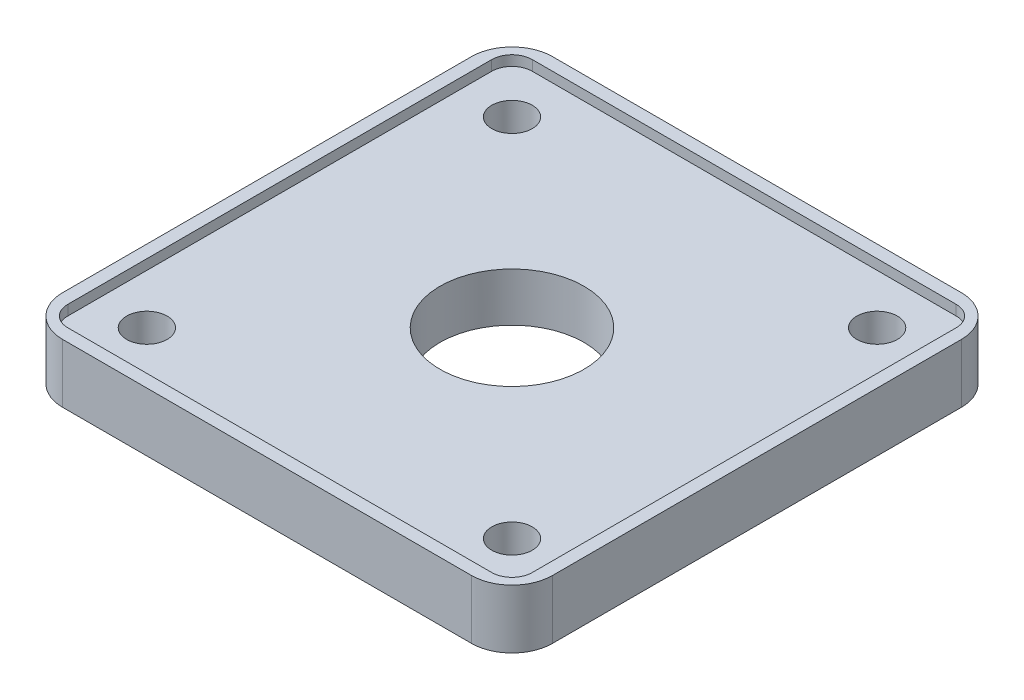
ISO-10303-21;
HEADER;
FILE_DESCRIPTION(('STEP AP214'),'2;1');
FILE_NAME('part.step','',(''),(''),'','','');
FILE_SCHEMA(('AUTOMOTIVE_DESIGN { 1 0 10303 214 1 1 1 1 }'));
ENDSEC;
DATA;
#1=APPLICATION_CONTEXT('core data for automotive mechanical design processes');
#2=APPLICATION_PROTOCOL_DEFINITION('international standard','automotive_design',2000,#1);
#3=PRODUCT_CONTEXT('',#1,'mechanical');
#4=PRODUCT('Part','Part','',(#3));
#5=PRODUCT_RELATED_PRODUCT_CATEGORY('part','',(#4));
#6=PRODUCT_DEFINITION_FORMATION('','',#4);
#7=PRODUCT_DEFINITION_CONTEXT('part definition',#1,'design');
#8=PRODUCT_DEFINITION('design','',#6,#7);
#9=PRODUCT_DEFINITION_SHAPE('','',#8);
#10=(LENGTH_UNIT() NAMED_UNIT(*) SI_UNIT(.MILLI.,.METRE.));
#11=(NAMED_UNIT(*) PLANE_ANGLE_UNIT() SI_UNIT($,.RADIAN.));
#12=(NAMED_UNIT(*) SI_UNIT($,.STERADIAN.) SOLID_ANGLE_UNIT());
#13=UNCERTAINTY_MEASURE_WITH_UNIT(LENGTH_MEASURE(1.E-05),#10,'distance_accuracy_value','');
#14=(GEOMETRIC_REPRESENTATION_CONTEXT(3) GLOBAL_UNCERTAINTY_ASSIGNED_CONTEXT((#13)) GLOBAL_UNIT_ASSIGNED_CONTEXT((#10,
#11,#12)) REPRESENTATION_CONTEXT('',''));
#15=CARTESIAN_POINT('',(0.,0.,0.));
#16=DIRECTION('',(0.,0.,1.));
#17=DIRECTION('',(1.,0.,0.));
#18=AXIS2_PLACEMENT_3D('',#15,#16,#17);
#19=CARTESIAN_POINT('',(20.15,5.8,20.15));
#20=DIRECTION('',(0.,1.,0.));
#21=DIRECTION('',(0.,0.,1.));
#22=AXIS2_PLACEMENT_3D('',#19,#20,#21);
#23=PLANE('',#22);
#24=CARTESIAN_POINT('',(20.9,5.8,-20.9));
#25=DIRECTION('',(0.,1.,0.));
#26=DIRECTION('',(0.,0.,-1.));
#27=AXIS2_PLACEMENT_3D('',#24,#25,#26);
#28=CIRCLE('',#27,2.);
#29=CARTESIAN_POINT('',(22.9,5.8,-20.9));
#30=VERTEX_POINT('',#29);
#31=CARTESIAN_POINT('',(20.9,5.8,-22.9));
#32=VERTEX_POINT('',#31);
#33=EDGE_CURVE('E48',#30,#32,#28,.T.);
#34=ORIENTED_EDGE('',*,*,#33,.F.);
#35=DIRECTION('',(0.,0.,-1.));
#36=VECTOR('',#35,1.);
#37=CARTESIAN_POINT('',(22.9,5.8,20.9));
#38=LINE('',#37,#36);
#39=CARTESIAN_POINT('',(22.9,5.8,20.9));
#40=VERTEX_POINT('',#39);
#41=EDGE_CURVE('E241',#40,#30,#38,.T.);
#42=ORIENTED_EDGE('',*,*,#41,.F.);
#43=CARTESIAN_POINT('',(20.9,5.8,20.9));
#44=DIRECTION('',(0.,1.,0.));
#45=DIRECTION('',(0.,0.,1.));
#46=AXIS2_PLACEMENT_3D('',#43,#44,#45);
#47=CIRCLE('',#46,2.);
#48=CARTESIAN_POINT('',(20.9,5.8,22.9));
#49=VERTEX_POINT('',#48);
#50=EDGE_CURVE('E245',#49,#40,#47,.T.);
#51=ORIENTED_EDGE('',*,*,#50,.F.);
#52=DIRECTION('',(1.,0.,0.));
#53=VECTOR('',#52,1.);
#54=CARTESIAN_POINT('',(-20.9,5.8,22.9));
#55=LINE('',#54,#53);
#56=CARTESIAN_POINT('',(-20.9,5.8,22.9));
#57=VERTEX_POINT('',#56);
#58=EDGE_CURVE('E248',#57,#49,#55,.T.);
#59=ORIENTED_EDGE('',*,*,#58,.F.);
#60=CARTESIAN_POINT('',(-20.9,5.8,20.9));
#61=DIRECTION('',(0.,1.,0.));
#62=DIRECTION('',(0.,0.,-1.));
#63=AXIS2_PLACEMENT_3D('',#60,#61,#62);
#64=CIRCLE('',#63,2.);
#65=CARTESIAN_POINT('',(-22.9,5.8,20.9));
#66=VERTEX_POINT('',#65);
#67=EDGE_CURVE('E251',#66,#57,#64,.T.);
#68=ORIENTED_EDGE('',*,*,#67,.F.);
#69=DIRECTION('',(0.,0.,1.));
#70=VECTOR('',#69,1.);
#71=CARTESIAN_POINT('',(-22.9,5.8,20.9));
#72=LINE('',#71,#70);
#73=CARTESIAN_POINT('',(-22.9,5.8,-20.9));
#74=VERTEX_POINT('',#73);
#75=EDGE_CURVE('E254',#74,#66,#72,.T.);
#76=ORIENTED_EDGE('',*,*,#75,.F.);
#77=CARTESIAN_POINT('',(-20.9,5.8,-20.9));
#78=DIRECTION('',(0.,1.,0.));
#79=DIRECTION('',(0.,0.,-1.));
#80=AXIS2_PLACEMENT_3D('',#77,#78,#79);
#81=CIRCLE('',#80,2.);
#82=CARTESIAN_POINT('',(-20.9,5.8,-22.9));
#83=VERTEX_POINT('',#82);
#84=EDGE_CURVE('E257',#83,#74,#81,.T.);
#85=ORIENTED_EDGE('',*,*,#84,.F.);
#86=DIRECTION('',(-1.,0.,0.));
#87=VECTOR('',#86,1.);
#88=CARTESIAN_POINT('',(-20.9,5.8,-22.9));
#89=LINE('',#88,#87);
#90=EDGE_CURVE('E260',#32,#83,#89,.T.);
#91=ORIENTED_EDGE('',*,*,#90,.F.);
#92=EDGE_LOOP('',(#34,#42,#51,#59,#68,#76,#85,#91));
#93=FACE_BOUND('',#92,.T.);
#94=CARTESIAN_POINT('',(20.15,5.8,20.15));
#95=DIRECTION('',(0.,1.,0.));
#96=DIRECTION('',(0.,0.,1.));
#97=AXIS2_PLACEMENT_3D('',#94,#95,#96);
#98=CIRCLE('',#97,4.);
#99=CARTESIAN_POINT('',(20.15,5.8,24.15));
#100=VERTEX_POINT('',#99);
#101=CARTESIAN_POINT('',(24.15,5.8,20.15));
#102=VERTEX_POINT('',#101);
#103=EDGE_CURVE('E157',#100,#102,#98,.T.);
#104=ORIENTED_EDGE('',*,*,#103,.T.);
#105=DIRECTION('',(0.,0.,-1.));
#106=VECTOR('',#105,1.);
#107=CARTESIAN_POINT('',(24.15,5.8,20.15));
#108=LINE('',#107,#106);
#109=CARTESIAN_POINT('',(24.15,5.8,-20.15));
#110=VERTEX_POINT('',#109);
#111=EDGE_CURVE('E98',#102,#110,#108,.T.);
#112=ORIENTED_EDGE('',*,*,#111,.T.);
#113=CARTESIAN_POINT('',(20.15,5.8,-20.15));
#114=DIRECTION('',(0.,1.,0.));
#115=DIRECTION('',(0.,0.,-1.));
#116=AXIS2_PLACEMENT_3D('',#113,#114,#115);
#117=CIRCLE('',#116,4.);
#118=CARTESIAN_POINT('',(20.15,5.8,-24.15));
#119=VERTEX_POINT('',#118);
#120=EDGE_CURVE('E173',#110,#119,#117,.T.);
#121=ORIENTED_EDGE('',*,*,#120,.T.);
#122=DIRECTION('',(-1.,0.,0.));
#123=VECTOR('',#122,1.);
#124=CARTESIAN_POINT('',(-20.15,5.8,-24.15));
#125=LINE('',#124,#123);
#126=CARTESIAN_POINT('',(-20.15,5.8,-24.15));
#127=VERTEX_POINT('',#126);
#128=EDGE_CURVE('E186',#119,#127,#125,.T.);
#129=ORIENTED_EDGE('',*,*,#128,.T.);
#130=CARTESIAN_POINT('',(-20.15,5.8,-20.15));
#131=DIRECTION('',(0.,1.,0.));
#132=DIRECTION('',(0.,0.,-1.));
#133=AXIS2_PLACEMENT_3D('',#130,#131,#132);
#134=CIRCLE('',#133,4.);
#135=CARTESIAN_POINT('',(-24.15,5.8,-20.15));
#136=VERTEX_POINT('',#135);
#137=EDGE_CURVE('E120',#127,#136,#134,.T.);
#138=ORIENTED_EDGE('',*,*,#137,.T.);
#139=DIRECTION('',(0.,0.,1.));
#140=VECTOR('',#139,1.);
#141=CARTESIAN_POINT('',(-24.15,5.8,20.15));
#142=LINE('',#141,#140);
#143=CARTESIAN_POINT('',(-24.15,5.8,20.15));
#144=VERTEX_POINT('',#143);
#145=EDGE_CURVE('E114',#136,#144,#142,.T.);
#146=ORIENTED_EDGE('',*,*,#145,.T.);
#147=CARTESIAN_POINT('',(-20.15,5.8,20.15));
#148=DIRECTION('',(0.,1.,0.));
#149=DIRECTION('',(0.,0.,-1.));
#150=AXIS2_PLACEMENT_3D('',#147,#148,#149);
#151=CIRCLE('',#150,4.);
#152=CARTESIAN_POINT('',(-20.15,5.8,24.15));
#153=VERTEX_POINT('',#152);
#154=EDGE_CURVE('E117',#144,#153,#151,.T.);
#155=ORIENTED_EDGE('',*,*,#154,.T.);
#156=DIRECTION('',(1.,0.,0.));
#157=VECTOR('',#156,1.);
#158=CARTESIAN_POINT('',(-20.15,5.8,24.15));
#159=LINE('',#158,#157);
#160=EDGE_CURVE('E57',#153,#100,#159,.T.);
#161=ORIENTED_EDGE('',*,*,#160,.T.);
#162=EDGE_LOOP('',(#104,#112,#121,#129,#138,#146,#155,#161));
#163=FACE_BOUND('',#162,.T.);
#164=ADVANCED_FACE('F32',(#93,#163),#23,.T.);
#165=CARTESIAN_POINT('',(20.15,0.,20.15));
#166=DIRECTION('',(0.,1.,0.));
#167=DIRECTION('',(0.,0.,1.));
#168=AXIS2_PLACEMENT_3D('',#165,#166,#167);
#169=PLANE('',#168);
#170=CARTESIAN_POINT('',(18.,0.,18.));
#171=DIRECTION('',(0.,1.,0.));
#172=DIRECTION('',(0.,0.,1.));
#173=AXIS2_PLACEMENT_3D('',#170,#171,#172);
#174=CIRCLE('',#173,2.00000000000001);
#175=CARTESIAN_POINT('',(18.,0.,20.));
#176=VERTEX_POINT('',#175);
#177=EDGE_CURVE('E200',#176,#176,#174,.T.);
#178=ORIENTED_EDGE('',*,*,#177,.T.);
#179=EDGE_LOOP('',(#178));
#180=FACE_BOUND('',#179,.T.);
#181=CARTESIAN_POINT('',(-18.,0.,-18.));
#182=DIRECTION('',(0.,1.,0.));
#183=DIRECTION('',(0.,0.,1.));
#184=AXIS2_PLACEMENT_3D('',#181,#182,#183);
#185=CIRCLE('',#184,2.);
#186=CARTESIAN_POINT('',(-18.,0.,-16.));
#187=VERTEX_POINT('',#186);
#188=EDGE_CURVE('E194',#187,#187,#185,.T.);
#189=ORIENTED_EDGE('',*,*,#188,.T.);
#190=EDGE_LOOP('',(#189));
#191=FACE_BOUND('',#190,.T.);
#192=CARTESIAN_POINT('',(20.15,0.,20.15));
#193=DIRECTION('',(0.,1.,0.));
#194=DIRECTION('',(0.,0.,1.));
#195=AXIS2_PLACEMENT_3D('',#192,#193,#194);
#196=CIRCLE('',#195,4.);
#197=CARTESIAN_POINT('',(20.15,0.,24.15));
#198=VERTEX_POINT('',#197);
#199=CARTESIAN_POINT('',(24.15,0.,20.15));
#200=VERTEX_POINT('',#199);
#201=EDGE_CURVE('E141',#198,#200,#196,.T.);
#202=ORIENTED_EDGE('',*,*,#201,.F.);
#203=DIRECTION('',(1.,0.,0.));
#204=VECTOR('',#203,1.);
#205=CARTESIAN_POINT('',(-20.15,0.,24.15));
#206=LINE('',#205,#204);
#207=CARTESIAN_POINT('',(-20.15,0.,24.15));
#208=VERTEX_POINT('',#207);
#209=EDGE_CURVE('E90',#208,#198,#206,.T.);
#210=ORIENTED_EDGE('',*,*,#209,.F.);
#211=CARTESIAN_POINT('',(-20.15,0.,20.15));
#212=DIRECTION('',(0.,1.,0.));
#213=DIRECTION('',(0.,0.,-1.));
#214=AXIS2_PLACEMENT_3D('',#211,#212,#213);
#215=CIRCLE('',#214,4.);
#216=CARTESIAN_POINT('',(-24.15,0.,20.15));
#217=VERTEX_POINT('',#216);
#218=EDGE_CURVE('E154',#217,#208,#215,.T.);
#219=ORIENTED_EDGE('',*,*,#218,.F.);
#220=DIRECTION('',(0.,0.,1.));
#221=VECTOR('',#220,1.);
#222=CARTESIAN_POINT('',(-24.15,0.,20.15));
#223=LINE('',#222,#221);
#224=CARTESIAN_POINT('',(-24.15,0.,-20.15));
#225=VERTEX_POINT('',#224);
#226=EDGE_CURVE('E129',#225,#217,#223,.T.);
#227=ORIENTED_EDGE('',*,*,#226,.F.);
#228=CARTESIAN_POINT('',(-20.15,0.,-20.15));
#229=DIRECTION('',(0.,1.,0.));
#230=DIRECTION('',(0.,0.,-1.));
#231=AXIS2_PLACEMENT_3D('',#228,#229,#230);
#232=CIRCLE('',#231,4.);
#233=CARTESIAN_POINT('',(-20.15,0.,-24.15));
#234=VERTEX_POINT('',#233);
#235=EDGE_CURVE('E151',#234,#225,#232,.T.);
#236=ORIENTED_EDGE('',*,*,#235,.F.);
#237=DIRECTION('',(-1.,0.,0.));
#238=VECTOR('',#237,1.);
#239=CARTESIAN_POINT('',(-20.15,0.,-24.15));
#240=LINE('',#239,#238);
#241=CARTESIAN_POINT('',(20.15,0.,-24.15));
#242=VERTEX_POINT('',#241);
#243=EDGE_CURVE('E149',#242,#234,#240,.T.);
#244=ORIENTED_EDGE('',*,*,#243,.F.);
#245=CARTESIAN_POINT('',(20.15,0.,-20.15));
#246=DIRECTION('',(0.,1.,0.));
#247=DIRECTION('',(0.,0.,-1.));
#248=AXIS2_PLACEMENT_3D('',#245,#246,#247);
#249=CIRCLE('',#248,4.);
#250=CARTESIAN_POINT('',(24.15,0.,-20.15));
#251=VERTEX_POINT('',#250);
#252=EDGE_CURVE('E147',#251,#242,#249,.T.);
#253=ORIENTED_EDGE('',*,*,#252,.F.);
#254=DIRECTION('',(0.,0.,-1.));
#255=VECTOR('',#254,1.);
#256=CARTESIAN_POINT('',(24.15,0.,20.15));
#257=LINE('',#256,#255);
#258=EDGE_CURVE('E144',#200,#251,#257,.T.);
#259=ORIENTED_EDGE('',*,*,#258,.F.);
#260=EDGE_LOOP('',(#202,#210,#219,#227,#236,#244,#253,#259));
#261=FACE_BOUND('',#260,.T.);
#262=CARTESIAN_POINT('',(0.,0.,0.));
#263=DIRECTION('',(0.,1.,0.));
#264=DIRECTION('',(0.,0.,1.));
#265=AXIS2_PLACEMENT_3D('',#262,#263,#264);
#266=CIRCLE('',#265,7.1);
#267=CARTESIAN_POINT('',(0.,0.,7.09999999999999));
#268=VERTEX_POINT('',#267);
#269=EDGE_CURVE('E145',#268,#268,#266,.T.);
#270=ORIENTED_EDGE('',*,*,#269,.T.);
#271=EDGE_LOOP('',(#270));
#272=FACE_BOUND('',#271,.T.);
#273=CARTESIAN_POINT('',(-18.,0.,18.));
#274=DIRECTION('',(0.,1.,0.));
#275=DIRECTION('',(0.,0.,1.));
#276=AXIS2_PLACEMENT_3D('',#273,#274,#275);
#277=CIRCLE('',#276,2.);
#278=CARTESIAN_POINT('',(-18.,0.,20.));
#279=VERTEX_POINT('',#278);
#280=EDGE_CURVE('E197',#279,#279,#277,.T.);
#281=ORIENTED_EDGE('',*,*,#280,.T.);
#282=EDGE_LOOP('',(#281));
#283=FACE_BOUND('',#282,.T.);
#284=CARTESIAN_POINT('',(18.,0.,-18.));
#285=DIRECTION('',(0.,1.,0.));
#286=DIRECTION('',(0.,0.,1.));
#287=AXIS2_PLACEMENT_3D('',#284,#285,#286);
#288=CIRCLE('',#287,2.00000000000001);
#289=CARTESIAN_POINT('',(18.,0.,-16.));
#290=VERTEX_POINT('',#289);
#291=EDGE_CURVE('E203',#290,#290,#288,.T.);
#292=ORIENTED_EDGE('',*,*,#291,.T.);
#293=EDGE_LOOP('',(#292));
#294=FACE_BOUND('',#293,.T.);
#295=ADVANCED_FACE('F177',(#180,#191,#261,#272,#283,#294),#169,.F.);
#296=CARTESIAN_POINT('',(20.15,5.8,20.15));
#297=DIRECTION('',(0.,-1.,0.));
#298=DIRECTION('',(0.,0.,-1.));
#299=AXIS2_PLACEMENT_3D('',#296,#297,#298);
#300=CYLINDRICAL_SURFACE('',#299,4.);
#301=ORIENTED_EDGE('',*,*,#201,.T.);
#302=DIRECTION('',(0.,-1.,0.));
#303=VECTOR('',#302,1.);
#304=CARTESIAN_POINT('',(24.15,5.8,20.15));
#305=LINE('',#304,#303);
#306=EDGE_CURVE('E11',#102,#200,#305,.T.);
#307=ORIENTED_EDGE('',*,*,#306,.F.);
#308=ORIENTED_EDGE('',*,*,#103,.F.);
#309=DIRECTION('',(0.,-1.,0.));
#310=VECTOR('',#309,1.);
#311=CARTESIAN_POINT('',(20.15,5.8,24.15));
#312=LINE('',#311,#310);
#313=EDGE_CURVE('E137',#100,#198,#312,.T.);
#314=ORIENTED_EDGE('',*,*,#313,.T.);
#315=EDGE_LOOP('',(#301,#307,#308,#314));
#316=FACE_BOUND('',#315,.T.);
#317=ADVANCED_FACE('F34',(#316),#300,.T.);
#318=CARTESIAN_POINT('',(24.15,5.8,20.15));
#319=DIRECTION('',(-1.,0.,0.));
#320=DIRECTION('',(0.,0.,1.));
#321=AXIS2_PLACEMENT_3D('',#318,#319,#320);
#322=PLANE('',#321);
#323=ORIENTED_EDGE('',*,*,#258,.T.);
#324=DIRECTION('',(0.,-1.,0.));
#325=VECTOR('',#324,1.);
#326=CARTESIAN_POINT('',(24.15,5.8,-20.15));
#327=LINE('',#326,#325);
#328=EDGE_CURVE('E41',#110,#251,#327,.T.);
#329=ORIENTED_EDGE('',*,*,#328,.F.);
#330=ORIENTED_EDGE('',*,*,#111,.F.);
#331=ORIENTED_EDGE('',*,*,#306,.T.);
#332=EDGE_LOOP('',(#323,#329,#330,#331));
#333=FACE_BOUND('',#332,.T.);
#334=ADVANCED_FACE('F382',(#333),#322,.F.);
#335=CARTESIAN_POINT('',(20.15,5.8,-20.15));
#336=DIRECTION('',(0.,-1.,0.));
#337=DIRECTION('',(0.,0.,-1.));
#338=AXIS2_PLACEMENT_3D('',#335,#336,#337);
#339=CYLINDRICAL_SURFACE('',#338,4.);
#340=ORIENTED_EDGE('',*,*,#252,.T.);
#341=DIRECTION('',(0.,-1.,0.));
#342=VECTOR('',#341,1.);
#343=CARTESIAN_POINT('',(20.15,5.8,-24.15));
#344=LINE('',#343,#342);
#345=EDGE_CURVE('E164',#119,#242,#344,.T.);
#346=ORIENTED_EDGE('',*,*,#345,.F.);
#347=ORIENTED_EDGE('',*,*,#120,.F.);
#348=ORIENTED_EDGE('',*,*,#328,.T.);
#349=EDGE_LOOP('',(#340,#346,#347,#348));
#350=FACE_BOUND('',#349,.T.);
#351=ADVANCED_FACE('F171',(#350),#339,.T.);
#352=CARTESIAN_POINT('',(-20.15,5.8,-24.15));
#353=DIRECTION('',(0.,0.,1.));
#354=DIRECTION('',(1.,0.,0.));
#355=AXIS2_PLACEMENT_3D('',#352,#353,#354);
#356=PLANE('',#355);
#357=ORIENTED_EDGE('',*,*,#243,.T.);
#358=DIRECTION('',(0.,-1.,0.));
#359=VECTOR('',#358,1.);
#360=CARTESIAN_POINT('',(-20.15,5.8,-24.15));
#361=LINE('',#360,#359);
#362=EDGE_CURVE('E161',#127,#234,#361,.T.);
#363=ORIENTED_EDGE('',*,*,#362,.F.);
#364=ORIENTED_EDGE('',*,*,#128,.F.);
#365=ORIENTED_EDGE('',*,*,#345,.T.);
#366=EDGE_LOOP('',(#357,#363,#364,#365));
#367=FACE_BOUND('',#366,.T.);
#368=ADVANCED_FACE('F182',(#367),#356,.F.);
#369=CARTESIAN_POINT('',(-20.15,5.8,-20.15));
#370=DIRECTION('',(0.,-1.,0.));
#371=DIRECTION('',(0.,0.,-1.));
#372=AXIS2_PLACEMENT_3D('',#369,#370,#371);
#373=CYLINDRICAL_SURFACE('',#372,4.);
#374=ORIENTED_EDGE('',*,*,#235,.T.);
#375=DIRECTION('',(0.,-1.,0.));
#376=VECTOR('',#375,1.);
#377=CARTESIAN_POINT('',(-24.15,5.8,-20.15));
#378=LINE('',#377,#376);
#379=EDGE_CURVE('E132',#136,#225,#378,.T.);
#380=ORIENTED_EDGE('',*,*,#379,.F.);
#381=ORIENTED_EDGE('',*,*,#137,.F.);
#382=ORIENTED_EDGE('',*,*,#362,.T.);
#383=EDGE_LOOP('',(#374,#380,#381,#382));
#384=FACE_BOUND('',#383,.T.);
#385=ADVANCED_FACE('F185',(#384),#373,.T.);
#386=CARTESIAN_POINT('',(-24.15,5.8,20.15));
#387=DIRECTION('',(1.,0.,0.));
#388=DIRECTION('',(0.,0.,-1.));
#389=AXIS2_PLACEMENT_3D('',#386,#387,#388);
#390=PLANE('',#389);
#391=ORIENTED_EDGE('',*,*,#226,.T.);
#392=DIRECTION('',(0.,-1.,0.));
#393=VECTOR('',#392,1.);
#394=CARTESIAN_POINT('',(-24.15,5.8,20.15));
#395=LINE('',#394,#393);
#396=EDGE_CURVE('E126',#144,#217,#395,.T.);
#397=ORIENTED_EDGE('',*,*,#396,.F.);
#398=ORIENTED_EDGE('',*,*,#145,.F.);
#399=ORIENTED_EDGE('',*,*,#379,.T.);
#400=EDGE_LOOP('',(#391,#397,#398,#399));
#401=FACE_BOUND('',#400,.T.);
#402=ADVANCED_FACE('F127',(#401),#390,.F.);
#403=CARTESIAN_POINT('',(-20.15,5.8,20.15));
#404=DIRECTION('',(0.,-1.,0.));
#405=DIRECTION('',(0.,0.,-1.));
#406=AXIS2_PLACEMENT_3D('',#403,#404,#405);
#407=CYLINDRICAL_SURFACE('',#406,4.);
#408=ORIENTED_EDGE('',*,*,#218,.T.);
#409=DIRECTION('',(0.,-1.,0.));
#410=VECTOR('',#409,1.);
#411=CARTESIAN_POINT('',(-20.15,5.8,24.15));
#412=LINE('',#411,#410);
#413=EDGE_CURVE('E133',#153,#208,#412,.T.);
#414=ORIENTED_EDGE('',*,*,#413,.F.);
#415=ORIENTED_EDGE('',*,*,#154,.F.);
#416=ORIENTED_EDGE('',*,*,#396,.T.);
#417=EDGE_LOOP('',(#408,#414,#415,#416));
#418=FACE_BOUND('',#417,.T.);
#419=ADVANCED_FACE('F135',(#418),#407,.T.);
#420=CARTESIAN_POINT('',(-20.15,5.8,24.15));
#421=DIRECTION('',(0.,0.,-1.));
#422=DIRECTION('',(-1.,0.,0.));
#423=AXIS2_PLACEMENT_3D('',#420,#421,#422);
#424=PLANE('',#423);
#425=ORIENTED_EDGE('',*,*,#209,.T.);
#426=ORIENTED_EDGE('',*,*,#313,.F.);
#427=ORIENTED_EDGE('',*,*,#160,.F.);
#428=ORIENTED_EDGE('',*,*,#413,.T.);
#429=EDGE_LOOP('',(#425,#426,#427,#428));
#430=FACE_BOUND('',#429,.T.);
#431=ADVANCED_FACE('F370',(#430),#424,.F.);
#432=CARTESIAN_POINT('',(0.,5.8,0.));
#433=DIRECTION('',(0.,-1.,0.));
#434=DIRECTION('',(0.,0.,-1.));
#435=AXIS2_PLACEMENT_3D('',#432,#433,#434);
#436=CYLINDRICAL_SURFACE('',#435,7.1);
#437=CARTESIAN_POINT('',(0.,4.8,0.));
#438=DIRECTION('',(0.,-1.,0.));
#439=DIRECTION('',(0.,0.,-1.));
#440=AXIS2_PLACEMENT_3D('',#437,#438,#439);
#441=CIRCLE('',#440,7.1);
#442=CARTESIAN_POINT('',(0.,4.8,-7.10000000000001));
#443=VERTEX_POINT('',#442);
#444=EDGE_CURVE('E206',#443,#443,#441,.T.);
#445=ORIENTED_EDGE('',*,*,#444,.F.);
#446=EDGE_LOOP('',(#445));
#447=FACE_BOUND('',#446,.T.);
#448=ORIENTED_EDGE('',*,*,#269,.F.);
#449=EDGE_LOOP('',(#448));
#450=FACE_BOUND('',#449,.T.);
#451=ADVANCED_FACE('F367',(#447,#450),#436,.F.);
#452=CARTESIAN_POINT('',(-18.,5.8,-18.));
#453=DIRECTION('',(0.,-1.,0.));
#454=DIRECTION('',(0.,0.,-1.));
#455=AXIS2_PLACEMENT_3D('',#452,#453,#454);
#456=CYLINDRICAL_SURFACE('',#455,2.);
#457=CARTESIAN_POINT('',(-18.,4.8,-18.));
#458=DIRECTION('',(0.,-1.,0.));
#459=DIRECTION('',(0.,0.,-1.));
#460=AXIS2_PLACEMENT_3D('',#457,#458,#459);
#461=CIRCLE('',#460,2.);
#462=CARTESIAN_POINT('',(-18.,4.8,-20.));
#463=VERTEX_POINT('',#462);
#464=EDGE_CURVE('E209',#463,#463,#461,.T.);
#465=ORIENTED_EDGE('',*,*,#464,.F.);
#466=EDGE_LOOP('',(#465));
#467=FACE_BOUND('',#466,.T.);
#468=ORIENTED_EDGE('',*,*,#188,.F.);
#469=EDGE_LOOP('',(#468));
#470=FACE_BOUND('',#469,.T.);
#471=ADVANCED_FACE('F445',(#467,#470),#456,.F.);
#472=CARTESIAN_POINT('',(-18.,5.8,18.));
#473=DIRECTION('',(0.,-1.,0.));
#474=DIRECTION('',(0.,0.,-1.));
#475=AXIS2_PLACEMENT_3D('',#472,#473,#474);
#476=CYLINDRICAL_SURFACE('',#475,2.);
#477=CARTESIAN_POINT('',(-18.,4.8,18.));
#478=DIRECTION('',(0.,-1.,0.));
#479=DIRECTION('',(0.,0.,-1.));
#480=AXIS2_PLACEMENT_3D('',#477,#478,#479);
#481=CIRCLE('',#480,2.);
#482=CARTESIAN_POINT('',(-18.,4.8,16.));
#483=VERTEX_POINT('',#482);
#484=EDGE_CURVE('E212',#483,#483,#481,.T.);
#485=ORIENTED_EDGE('',*,*,#484,.F.);
#486=EDGE_LOOP('',(#485));
#487=FACE_BOUND('',#486,.T.);
#488=ORIENTED_EDGE('',*,*,#280,.F.);
#489=EDGE_LOOP('',(#488));
#490=FACE_BOUND('',#489,.T.);
#491=ADVANCED_FACE('F453',(#487,#490),#476,.F.);
#492=CARTESIAN_POINT('',(18.,5.8,18.));
#493=DIRECTION('',(0.,-1.,0.));
#494=DIRECTION('',(0.,0.,-1.));
#495=AXIS2_PLACEMENT_3D('',#492,#493,#494);
#496=CYLINDRICAL_SURFACE('',#495,2.00000000000001);
#497=CARTESIAN_POINT('',(18.,4.8,18.));
#498=DIRECTION('',(0.,-1.,0.));
#499=DIRECTION('',(0.,0.,-1.));
#500=AXIS2_PLACEMENT_3D('',#497,#498,#499);
#501=CIRCLE('',#500,2.00000000000001);
#502=CARTESIAN_POINT('',(18.,4.8,16.));
#503=VERTEX_POINT('',#502);
#504=EDGE_CURVE('E215',#503,#503,#501,.T.);
#505=ORIENTED_EDGE('',*,*,#504,.F.);
#506=EDGE_LOOP('',(#505));
#507=FACE_BOUND('',#506,.T.);
#508=ORIENTED_EDGE('',*,*,#177,.F.);
#509=EDGE_LOOP('',(#508));
#510=FACE_BOUND('',#509,.T.);
#511=ADVANCED_FACE('F461',(#507,#510),#496,.F.);
#512=CARTESIAN_POINT('',(18.,5.8,-18.));
#513=DIRECTION('',(0.,-1.,0.));
#514=DIRECTION('',(0.,0.,-1.));
#515=AXIS2_PLACEMENT_3D('',#512,#513,#514);
#516=CYLINDRICAL_SURFACE('',#515,2.00000000000001);
#517=CARTESIAN_POINT('',(18.,4.8,-18.));
#518=DIRECTION('',(0.,-1.,0.));
#519=DIRECTION('',(0.,0.,-1.));
#520=AXIS2_PLACEMENT_3D('',#517,#518,#519);
#521=CIRCLE('',#520,2.00000000000001);
#522=CARTESIAN_POINT('',(18.,4.8,-20.));
#523=VERTEX_POINT('',#522);
#524=EDGE_CURVE('E36',#523,#523,#521,.T.);
#525=ORIENTED_EDGE('',*,*,#524,.F.);
#526=EDGE_LOOP('',(#525));
#527=FACE_BOUND('',#526,.T.);
#528=ORIENTED_EDGE('',*,*,#291,.F.);
#529=EDGE_LOOP('',(#528));
#530=FACE_BOUND('',#529,.T.);
#531=ADVANCED_FACE('F470',(#527,#530),#516,.F.);
#532=CARTESIAN_POINT('',(20.9,4.8,-20.9));
#533=DIRECTION('',(0.,1.,0.));
#534=DIRECTION('',(0.,0.,1.));
#535=AXIS2_PLACEMENT_3D('',#532,#533,#534);
#536=CYLINDRICAL_SURFACE('',#535,2.);
#537=ORIENTED_EDGE('',*,*,#33,.T.);
#538=DIRECTION('',(0.,1.,0.));
#539=VECTOR('',#538,1.);
#540=CARTESIAN_POINT('',(20.9,4.8,-22.9));
#541=LINE('',#540,#539);
#542=CARTESIAN_POINT('',(20.9,4.8,-22.9));
#543=VERTEX_POINT('',#542);
#544=EDGE_CURVE('E218',#543,#32,#541,.T.);
#545=ORIENTED_EDGE('',*,*,#544,.F.);
#546=CARTESIAN_POINT('',(20.9,4.8,-20.9));
#547=DIRECTION('',(0.,1.,0.));
#548=DIRECTION('',(0.,0.,-1.));
#549=AXIS2_PLACEMENT_3D('',#546,#547,#548);
#550=CIRCLE('',#549,2.);
#551=CARTESIAN_POINT('',(22.9,4.8,-20.9));
#552=VERTEX_POINT('',#551);
#553=EDGE_CURVE('E244',#552,#543,#550,.T.);
#554=ORIENTED_EDGE('',*,*,#553,.F.);
#555=DIRECTION('',(0.,1.,0.));
#556=VECTOR('',#555,1.);
#557=CARTESIAN_POINT('',(22.9,4.8,-20.9));
#558=LINE('',#557,#556);
#559=EDGE_CURVE('E239',#552,#30,#558,.T.);
#560=ORIENTED_EDGE('',*,*,#559,.T.);
#561=EDGE_LOOP('',(#537,#545,#554,#560));
#562=FACE_BOUND('',#561,.T.);
#563=ADVANCED_FACE('F293',(#562),#536,.F.);
#564=CARTESIAN_POINT('',(22.9,4.8,20.9));
#565=DIRECTION('',(1.,0.,0.));
#566=DIRECTION('',(0.,0.,-1.));
#567=AXIS2_PLACEMENT_3D('',#564,#565,#566);
#568=PLANE('',#567);
#569=ORIENTED_EDGE('',*,*,#41,.T.);
#570=ORIENTED_EDGE('',*,*,#559,.F.);
#571=DIRECTION('',(0.,0.,-1.));
#572=VECTOR('',#571,1.);
#573=CARTESIAN_POINT('',(22.9,4.8,20.9));
#574=LINE('',#573,#572);
#575=CARTESIAN_POINT('',(22.9,4.8,20.9));
#576=VERTEX_POINT('',#575);
#577=EDGE_CURVE('E221',#576,#552,#574,.T.);
#578=ORIENTED_EDGE('',*,*,#577,.F.);
#579=DIRECTION('',(0.,1.,0.));
#580=VECTOR('',#579,1.);
#581=CARTESIAN_POINT('',(22.9,4.8,20.9));
#582=LINE('',#581,#580);
#583=EDGE_CURVE('E236',#576,#40,#582,.T.);
#584=ORIENTED_EDGE('',*,*,#583,.T.);
#585=EDGE_LOOP('',(#569,#570,#578,#584));
#586=FACE_BOUND('',#585,.T.);
#587=ADVANCED_FACE('F313',(#586),#568,.F.);
#588=CARTESIAN_POINT('',(20.9,4.8,20.9));
#589=DIRECTION('',(0.,1.,0.));
#590=DIRECTION('',(0.,0.,1.));
#591=AXIS2_PLACEMENT_3D('',#588,#589,#590);
#592=CYLINDRICAL_SURFACE('',#591,2.);
#593=ORIENTED_EDGE('',*,*,#50,.T.);
#594=ORIENTED_EDGE('',*,*,#583,.F.);
#595=CARTESIAN_POINT('',(20.9,4.8,20.9));
#596=DIRECTION('',(0.,1.,0.));
#597=DIRECTION('',(0.,0.,1.));
#598=AXIS2_PLACEMENT_3D('',#595,#596,#597);
#599=CIRCLE('',#598,2.);
#600=CARTESIAN_POINT('',(20.9,4.8,22.9));
#601=VERTEX_POINT('',#600);
#602=EDGE_CURVE('E266',#601,#576,#599,.T.);
#603=ORIENTED_EDGE('',*,*,#602,.F.);
#604=DIRECTION('',(0.,1.,0.));
#605=VECTOR('',#604,1.);
#606=CARTESIAN_POINT('',(20.9,4.8,22.9));
#607=LINE('',#606,#605);
#608=EDGE_CURVE('E233',#601,#49,#607,.T.);
#609=ORIENTED_EDGE('',*,*,#608,.T.);
#610=EDGE_LOOP('',(#593,#594,#603,#609));
#611=FACE_BOUND('',#610,.T.);
#612=ADVANCED_FACE('F318',(#611),#592,.F.);
#613=CARTESIAN_POINT('',(-20.9,4.8,22.9));
#614=DIRECTION('',(0.,0.,1.));
#615=DIRECTION('',(1.,0.,0.));
#616=AXIS2_PLACEMENT_3D('',#613,#614,#615);
#617=PLANE('',#616);
#618=ORIENTED_EDGE('',*,*,#58,.T.);
#619=ORIENTED_EDGE('',*,*,#608,.F.);
#620=DIRECTION('',(1.,0.,0.));
#621=VECTOR('',#620,1.);
#622=CARTESIAN_POINT('',(-20.9,4.8,22.9));
#623=LINE('',#622,#621);
#624=CARTESIAN_POINT('',(-20.9,4.8,22.9));
#625=VERTEX_POINT('',#624);
#626=EDGE_CURVE('E269',#625,#601,#623,.T.);
#627=ORIENTED_EDGE('',*,*,#626,.F.);
#628=DIRECTION('',(0.,1.,0.));
#629=VECTOR('',#628,1.);
#630=CARTESIAN_POINT('',(-20.9,4.8,22.9));
#631=LINE('',#630,#629);
#632=EDGE_CURVE('E230',#625,#57,#631,.T.);
#633=ORIENTED_EDGE('',*,*,#632,.T.);
#634=EDGE_LOOP('',(#618,#619,#627,#633));
#635=FACE_BOUND('',#634,.T.);
#636=ADVANCED_FACE('F344',(#635),#617,.F.);
#637=CARTESIAN_POINT('',(-20.9,4.8,20.9));
#638=DIRECTION('',(0.,1.,0.));
#639=DIRECTION('',(0.,0.,1.));
#640=AXIS2_PLACEMENT_3D('',#637,#638,#639);
#641=CYLINDRICAL_SURFACE('',#640,2.);
#642=ORIENTED_EDGE('',*,*,#67,.T.);
#643=ORIENTED_EDGE('',*,*,#632,.F.);
#644=CARTESIAN_POINT('',(-20.9,4.8,20.9));
#645=DIRECTION('',(0.,1.,0.));
#646=DIRECTION('',(0.,0.,-1.));
#647=AXIS2_PLACEMENT_3D('',#644,#645,#646);
#648=CIRCLE('',#647,2.);
#649=CARTESIAN_POINT('',(-22.9,4.8,20.9));
#650=VERTEX_POINT('',#649);
#651=EDGE_CURVE('E272',#650,#625,#648,.T.);
#652=ORIENTED_EDGE('',*,*,#651,.F.);
#653=DIRECTION('',(0.,1.,0.));
#654=VECTOR('',#653,1.);
#655=CARTESIAN_POINT('',(-22.9,4.8,20.9));
#656=LINE('',#655,#654);
#657=EDGE_CURVE('E227',#650,#66,#656,.T.);
#658=ORIENTED_EDGE('',*,*,#657,.T.);
#659=EDGE_LOOP('',(#642,#643,#652,#658));
#660=FACE_BOUND('',#659,.T.);
#661=ADVANCED_FACE('F347',(#660),#641,.F.);
#662=CARTESIAN_POINT('',(-22.9,4.8,20.9));
#663=DIRECTION('',(-1.,0.,0.));
#664=DIRECTION('',(0.,0.,1.));
#665=AXIS2_PLACEMENT_3D('',#662,#663,#664);
#666=PLANE('',#665);
#667=ORIENTED_EDGE('',*,*,#75,.T.);
#668=ORIENTED_EDGE('',*,*,#657,.F.);
#669=DIRECTION('',(0.,0.,1.));
#670=VECTOR('',#669,1.);
#671=CARTESIAN_POINT('',(-22.9,4.8,20.9));
#672=LINE('',#671,#670);
#673=CARTESIAN_POINT('',(-22.9,4.8,-20.9));
#674=VERTEX_POINT('',#673);
#675=EDGE_CURVE('E275',#674,#650,#672,.T.);
#676=ORIENTED_EDGE('',*,*,#675,.F.);
#677=DIRECTION('',(0.,1.,0.));
#678=VECTOR('',#677,1.);
#679=CARTESIAN_POINT('',(-22.9,4.8,-20.9));
#680=LINE('',#679,#678);
#681=EDGE_CURVE('E224',#674,#74,#680,.T.);
#682=ORIENTED_EDGE('',*,*,#681,.T.);
#683=EDGE_LOOP('',(#667,#668,#676,#682));
#684=FACE_BOUND('',#683,.T.);
#685=ADVANCED_FACE('F350',(#684),#666,.F.);
#686=CARTESIAN_POINT('',(-20.9,4.8,-20.9));
#687=DIRECTION('',(0.,1.,0.));
#688=DIRECTION('',(0.,0.,1.));
#689=AXIS2_PLACEMENT_3D('',#686,#687,#688);
#690=CYLINDRICAL_SURFACE('',#689,2.);
#691=ORIENTED_EDGE('',*,*,#84,.T.);
#692=ORIENTED_EDGE('',*,*,#681,.F.);
#693=CARTESIAN_POINT('',(-20.9,4.8,-20.9));
#694=DIRECTION('',(0.,1.,0.));
#695=DIRECTION('',(0.,0.,-1.));
#696=AXIS2_PLACEMENT_3D('',#693,#694,#695);
#697=CIRCLE('',#696,2.);
#698=CARTESIAN_POINT('',(-20.9,4.8,-22.9));
#699=VERTEX_POINT('',#698);
#700=EDGE_CURVE('E278',#699,#674,#697,.T.);
#701=ORIENTED_EDGE('',*,*,#700,.F.);
#702=DIRECTION('',(0.,1.,0.));
#703=VECTOR('',#702,1.);
#704=CARTESIAN_POINT('',(-20.9,4.8,-22.9));
#705=LINE('',#704,#703);
#706=EDGE_CURVE('E220',#699,#83,#705,.T.);
#707=ORIENTED_EDGE('',*,*,#706,.T.);
#708=EDGE_LOOP('',(#691,#692,#701,#707));
#709=FACE_BOUND('',#708,.T.);
#710=ADVANCED_FACE('F333',(#709),#690,.F.);
#711=CARTESIAN_POINT('',(-20.9,4.8,-22.9));
#712=DIRECTION('',(0.,0.,-1.));
#713=DIRECTION('',(-1.,0.,0.));
#714=AXIS2_PLACEMENT_3D('',#711,#712,#713);
#715=PLANE('',#714);
#716=ORIENTED_EDGE('',*,*,#90,.T.);
#717=ORIENTED_EDGE('',*,*,#706,.F.);
#718=DIRECTION('',(-1.,0.,0.));
#719=VECTOR('',#718,1.);
#720=CARTESIAN_POINT('',(-20.9,4.8,-22.9));
#721=LINE('',#720,#719);
#722=EDGE_CURVE('E281',#543,#699,#721,.T.);
#723=ORIENTED_EDGE('',*,*,#722,.F.);
#724=ORIENTED_EDGE('',*,*,#544,.T.);
#725=EDGE_LOOP('',(#716,#717,#723,#724));
#726=FACE_BOUND('',#725,.T.);
#727=ADVANCED_FACE('F327',(#726),#715,.F.);
#728=CARTESIAN_POINT('',(20.9,4.8,-20.9));
#729=DIRECTION('',(0.,-1.,0.));
#730=DIRECTION('',(0.,0.,-1.));
#731=AXIS2_PLACEMENT_3D('',#728,#729,#730);
#732=PLANE('',#731);
#733=ORIENTED_EDGE('',*,*,#444,.T.);
#734=EDGE_LOOP('',(#733));
#735=FACE_BOUND('',#734,.T.);
#736=ORIENTED_EDGE('',*,*,#464,.T.);
#737=EDGE_LOOP('',(#736));
#738=FACE_BOUND('',#737,.T.);
#739=ORIENTED_EDGE('',*,*,#484,.T.);
#740=EDGE_LOOP('',(#739));
#741=FACE_BOUND('',#740,.T.);
#742=ORIENTED_EDGE('',*,*,#504,.T.);
#743=EDGE_LOOP('',(#742));
#744=FACE_BOUND('',#743,.T.);
#745=ORIENTED_EDGE('',*,*,#524,.T.);
#746=EDGE_LOOP('',(#745));
#747=FACE_BOUND('',#746,.T.);
#748=ORIENTED_EDGE('',*,*,#553,.T.);
#749=ORIENTED_EDGE('',*,*,#722,.T.);
#750=ORIENTED_EDGE('',*,*,#700,.T.);
#751=ORIENTED_EDGE('',*,*,#675,.T.);
#752=ORIENTED_EDGE('',*,*,#651,.T.);
#753=ORIENTED_EDGE('',*,*,#626,.T.);
#754=ORIENTED_EDGE('',*,*,#602,.T.);
#755=ORIENTED_EDGE('',*,*,#577,.T.);
#756=EDGE_LOOP('',(#748,#749,#750,#751,#752,#753,#754,#755));
#757=FACE_BOUND('',#756,.T.);
#758=ADVANCED_FACE('F288',(#735,#738,#741,#744,#747,#757),#732,.F.);
#759=CLOSED_SHELL('',(#164,#295,#317,#334,#351,#368,#385,#402,#419,#431,#451,#471,#491,#511,
#531,#563,#587,#612,#636,#661,#685,#710,#727,#758));
#760=MANIFOLD_SOLID_BREP('B2',#759);
#761=ADVANCED_BREP_SHAPE_REPRESENTATION('',(#18,#760),#14);
#762=SHAPE_DEFINITION_REPRESENTATION(#9,#761);
ENDSEC;
END-ISO-10303-21;
